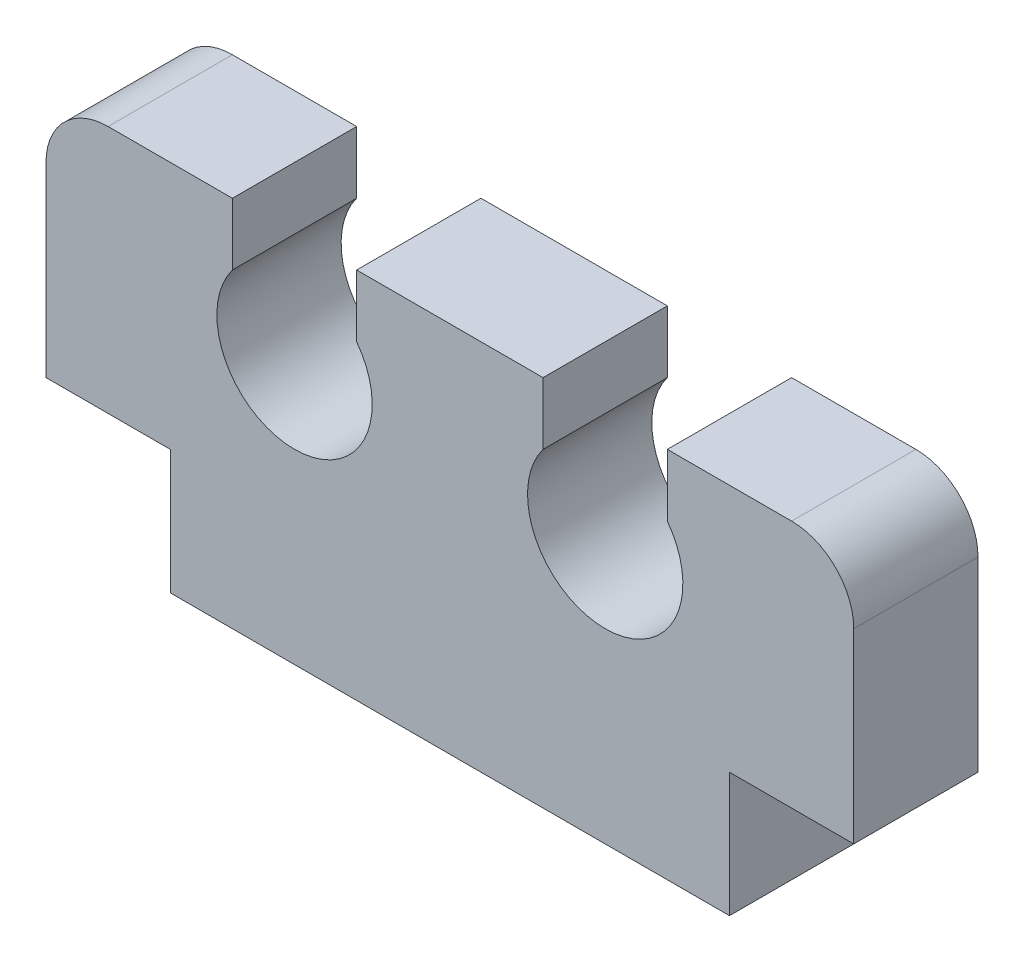
ISO-10303-21;
HEADER;
FILE_DESCRIPTION(('STEP AP214'),'2;1');
FILE_NAME('part.step','',(''),(''),'','','');
FILE_SCHEMA(('AUTOMOTIVE_DESIGN { 1 0 10303 214 1 1 1 1 }'));
ENDSEC;
DATA;
#1=APPLICATION_CONTEXT('core data for automotive mechanical design processes');
#2=APPLICATION_PROTOCOL_DEFINITION('international standard','automotive_design',2000,#1);
#3=PRODUCT_CONTEXT('',#1,'mechanical');
#4=PRODUCT('Part','Part','',(#3));
#5=PRODUCT_RELATED_PRODUCT_CATEGORY('part','',(#4));
#6=PRODUCT_DEFINITION_FORMATION('','',#4);
#7=PRODUCT_DEFINITION_CONTEXT('part definition',#1,'design');
#8=PRODUCT_DEFINITION('design','',#6,#7);
#9=PRODUCT_DEFINITION_SHAPE('','',#8);
#10=(LENGTH_UNIT() NAMED_UNIT(*) SI_UNIT(.MILLI.,.METRE.));
#11=(NAMED_UNIT(*) PLANE_ANGLE_UNIT() SI_UNIT($,.RADIAN.));
#12=(NAMED_UNIT(*) SI_UNIT($,.STERADIAN.) SOLID_ANGLE_UNIT());
#13=UNCERTAINTY_MEASURE_WITH_UNIT(LENGTH_MEASURE(1.E-05),#10,'distance_accuracy_value','');
#14=(GEOMETRIC_REPRESENTATION_CONTEXT(3) GLOBAL_UNCERTAINTY_ASSIGNED_CONTEXT((#13)) GLOBAL_UNIT_ASSIGNED_CONTEXT((#10,
#11,#12)) REPRESENTATION_CONTEXT('',''));
#15=CARTESIAN_POINT('',(0.,0.,0.));
#16=DIRECTION('',(0.,0.,1.));
#17=DIRECTION('',(1.,0.,0.));
#18=AXIS2_PLACEMENT_3D('',#15,#16,#17);
#19=CARTESIAN_POINT('',(10.0000000000022,5.00000000000011,2.));
#20=DIRECTION('',(0.,0.,-1.));
#21=DIRECTION('',(-1.,0.,0.));
#22=AXIS2_PLACEMENT_3D('',#19,#20,#21);
#23=CYLINDRICAL_SURFACE('',#22,1.);
#24=CARTESIAN_POINT('',(10.0000000000022,5.00000000000011,0.));
#25=DIRECTION('',(0.,0.,1.));
#26=DIRECTION('',(1.,0.,0.));
#27=AXIS2_PLACEMENT_3D('',#24,#25,#26);
#28=CIRCLE('',#27,1.);
#29=CARTESIAN_POINT('',(11.0000000000022,5.00000000000011,0.));
#30=VERTEX_POINT('',#29);
#31=CARTESIAN_POINT('',(10.0000000000022,6.00000000000012,0.));
#32=VERTEX_POINT('',#31);
#33=EDGE_CURVE('E189',#30,#32,#28,.T.);
#34=ORIENTED_EDGE('',*,*,#33,.T.);
#35=DIRECTION('',(0.,0.,-1.));
#36=VECTOR('',#35,1.);
#37=CARTESIAN_POINT('',(10.0000000000022,6.00000000000012,2.));
#38=LINE('',#37,#36);
#39=CARTESIAN_POINT('',(10.0000000000022,6.00000000000012,2.));
#40=VERTEX_POINT('',#39);
#41=EDGE_CURVE('E11',#40,#32,#38,.T.);
#42=ORIENTED_EDGE('',*,*,#41,.F.);
#43=CARTESIAN_POINT('',(10.0000000000022,5.00000000000011,2.));
#44=DIRECTION('',(0.,0.,1.));
#45=DIRECTION('',(1.,0.,0.));
#46=AXIS2_PLACEMENT_3D('',#43,#44,#45);
#47=CIRCLE('',#46,1.);
#48=CARTESIAN_POINT('',(11.0000000000022,5.00000000000011,2.));
#49=VERTEX_POINT('',#48);
#50=EDGE_CURVE('E223',#49,#40,#47,.T.);
#51=ORIENTED_EDGE('',*,*,#50,.F.);
#52=DIRECTION('',(0.,0.,-1.));
#53=VECTOR('',#52,1.);
#54=CARTESIAN_POINT('',(11.0000000000022,5.00000000000011,2.));
#55=LINE('',#54,#53);
#56=EDGE_CURVE('E185',#49,#30,#55,.T.);
#57=ORIENTED_EDGE('',*,*,#56,.T.);
#58=EDGE_LOOP('',(#34,#42,#51,#57));
#59=FACE_BOUND('',#58,.T.);
#60=ADVANCED_FACE('F33',(#59),#23,.T.);
#61=CARTESIAN_POINT('',(8.00000000000216,6.00000000000012,2.));
#62=DIRECTION('',(0.,-1.,0.));
#63=DIRECTION('',(0.,0.,-1.));
#64=AXIS2_PLACEMENT_3D('',#61,#62,#63);
#65=PLANE('',#64);
#66=DIRECTION('',(-1.,0.,0.));
#67=VECTOR('',#66,1.);
#68=CARTESIAN_POINT('',(8.00000000000216,6.00000000000012,0.));
#69=LINE('',#68,#67);
#70=CARTESIAN_POINT('',(8.00000000000216,6.00000000000012,0.));
#71=VERTEX_POINT('',#70);
#72=EDGE_CURVE('E192',#32,#71,#69,.T.);
#73=ORIENTED_EDGE('',*,*,#72,.T.);
#74=DIRECTION('',(0.,0.,-1.));
#75=VECTOR('',#74,1.);
#76=CARTESIAN_POINT('',(8.00000000000216,6.00000000000012,2.));
#77=LINE('',#76,#75);
#78=CARTESIAN_POINT('',(8.00000000000216,6.00000000000012,2.));
#79=VERTEX_POINT('',#78);
#80=EDGE_CURVE('E41',#79,#71,#77,.T.);
#81=ORIENTED_EDGE('',*,*,#80,.F.);
#82=DIRECTION('',(-1.,0.,0.));
#83=VECTOR('',#82,1.);
#84=CARTESIAN_POINT('',(8.00000000000216,6.00000000000012,2.));
#85=LINE('',#84,#83);
#86=EDGE_CURVE('E122',#40,#79,#85,.T.);
#87=ORIENTED_EDGE('',*,*,#86,.F.);
#88=ORIENTED_EDGE('',*,*,#41,.T.);
#89=EDGE_LOOP('',(#73,#81,#87,#88));
#90=FACE_BOUND('',#89,.T.);
#91=ADVANCED_FACE('F331',(#90),#65,.F.);
#92=CARTESIAN_POINT('',(8.00000000000216,6.00000000000012,2.));
#93=DIRECTION('',(1.,0.,0.));
#94=DIRECTION('',(0.,0.,-1.));
#95=AXIS2_PLACEMENT_3D('',#92,#93,#94);
#96=PLANE('',#95);
#97=DIRECTION('',(0.,-1.,0.));
#98=VECTOR('',#97,1.);
#99=CARTESIAN_POINT('',(8.00000000000216,6.00000000000012,0.));
#100=LINE('',#99,#98);
#101=CARTESIAN_POINT('',(8.00000000000216,5.00000000000011,0.));
#102=VERTEX_POINT('',#101);
#103=EDGE_CURVE('E194',#71,#102,#100,.T.);
#104=ORIENTED_EDGE('',*,*,#103,.T.);
#105=DIRECTION('',(0.,0.,-1.));
#106=VECTOR('',#105,1.);
#107=CARTESIAN_POINT('',(8.00000000000216,5.00000000000011,2.));
#108=LINE('',#107,#106);
#109=CARTESIAN_POINT('',(8.00000000000216,5.00000000000011,2.));
#110=VERTEX_POINT('',#109);
#111=EDGE_CURVE('E260',#110,#102,#108,.T.);
#112=ORIENTED_EDGE('',*,*,#111,.F.);
#113=DIRECTION('',(0.,-1.,0.));
#114=VECTOR('',#113,1.);
#115=CARTESIAN_POINT('',(8.00000000000216,6.00000000000012,2.));
#116=LINE('',#115,#114);
#117=EDGE_CURVE('E268',#79,#110,#116,.T.);
#118=ORIENTED_EDGE('',*,*,#117,.F.);
#119=ORIENTED_EDGE('',*,*,#80,.T.);
#120=EDGE_LOOP('',(#104,#112,#118,#119));
#121=FACE_BOUND('',#120,.T.);
#122=ADVANCED_FACE('F266',(#121),#96,.F.);
#123=CARTESIAN_POINT('',(7.00000000000165,4.24999999999984,2.));
#124=DIRECTION('',(0.,0.,-1.));
#125=DIRECTION('',(-1.,0.,0.));
#126=AXIS2_PLACEMENT_3D('',#123,#124,#125);
#127=CYLINDRICAL_SURFACE('',#126,1.25000000000057);
#128=CARTESIAN_POINT('',(7.00000000000165,4.24999999999984,0.));
#129=DIRECTION('',(0.,0.,-1.));
#130=DIRECTION('',(1.,0.,0.));
#131=AXIS2_PLACEMENT_3D('',#128,#129,#130);
#132=CIRCLE('',#131,1.25000000000057);
#133=CARTESIAN_POINT('',(6.00000000000114,5.00000000000011,0.));
#134=VERTEX_POINT('',#133);
#135=EDGE_CURVE('E196',#102,#134,#132,.T.);
#136=ORIENTED_EDGE('',*,*,#135,.T.);
#137=DIRECTION('',(0.,0.,-1.));
#138=VECTOR('',#137,1.);
#139=CARTESIAN_POINT('',(6.00000000000114,5.00000000000011,2.));
#140=LINE('',#139,#138);
#141=CARTESIAN_POINT('',(6.00000000000114,5.00000000000011,2.));
#142=VERTEX_POINT('',#141);
#143=EDGE_CURVE('E257',#142,#134,#140,.T.);
#144=ORIENTED_EDGE('',*,*,#143,.F.);
#145=CARTESIAN_POINT('',(7.00000000000165,4.24999999999984,2.));
#146=DIRECTION('',(0.,0.,-1.));
#147=DIRECTION('',(1.,0.,0.));
#148=AXIS2_PLACEMENT_3D('',#145,#146,#147);
#149=CIRCLE('',#148,1.25000000000057);
#150=EDGE_CURVE('E286',#110,#142,#149,.T.);
#151=ORIENTED_EDGE('',*,*,#150,.F.);
#152=ORIENTED_EDGE('',*,*,#111,.T.);
#153=EDGE_LOOP('',(#136,#144,#151,#152));
#154=FACE_BOUND('',#153,.T.);
#155=ADVANCED_FACE('F277',(#154),#127,.F.);
#156=CARTESIAN_POINT('',(6.00000000000114,6.00000000000012,2.));
#157=DIRECTION('',(-1.,0.,0.));
#158=DIRECTION('',(0.,0.,1.));
#159=AXIS2_PLACEMENT_3D('',#156,#157,#158);
#160=PLANE('',#159);
#161=DIRECTION('',(0.,1.,0.));
#162=VECTOR('',#161,1.);
#163=CARTESIAN_POINT('',(6.00000000000114,6.00000000000012,0.));
#164=LINE('',#163,#162);
#165=CARTESIAN_POINT('',(6.00000000000114,6.00000000000012,0.));
#166=VERTEX_POINT('',#165);
#167=EDGE_CURVE('E198',#134,#166,#164,.T.);
#168=ORIENTED_EDGE('',*,*,#167,.T.);
#169=DIRECTION('',(0.,0.,-1.));
#170=VECTOR('',#169,1.);
#171=CARTESIAN_POINT('',(6.00000000000114,6.00000000000012,2.));
#172=LINE('',#171,#170);
#173=CARTESIAN_POINT('',(6.00000000000114,6.00000000000012,2.));
#174=VERTEX_POINT('',#173);
#175=EDGE_CURVE('E254',#174,#166,#172,.T.);
#176=ORIENTED_EDGE('',*,*,#175,.F.);
#177=DIRECTION('',(0.,1.,0.));
#178=VECTOR('',#177,1.);
#179=CARTESIAN_POINT('',(6.00000000000114,6.00000000000012,2.));
#180=LINE('',#179,#178);
#181=EDGE_CURVE('E283',#142,#174,#180,.T.);
#182=ORIENTED_EDGE('',*,*,#181,.F.);
#183=ORIENTED_EDGE('',*,*,#143,.T.);
#184=EDGE_LOOP('',(#168,#176,#182,#183));
#185=FACE_BOUND('',#184,.T.);
#186=ADVANCED_FACE('F281',(#185),#160,.F.);
#187=CARTESIAN_POINT('',(3.00000000000102,6.00000000000012,2.));
#188=DIRECTION('',(0.,-1.,0.));
#189=DIRECTION('',(1.,0.,0.));
#190=AXIS2_PLACEMENT_3D('',#187,#188,#189);
#191=PLANE('',#190);
#192=DIRECTION('',(-1.,0.,0.));
#193=VECTOR('',#192,1.);
#194=CARTESIAN_POINT('',(3.00000000000102,6.00000000000012,0.));
#195=LINE('',#194,#193);
#196=CARTESIAN_POINT('',(3.00000000000102,6.00000000000012,0.));
#197=VERTEX_POINT('',#196);
#198=EDGE_CURVE('E200',#166,#197,#195,.T.);
#199=ORIENTED_EDGE('',*,*,#198,.T.);
#200=DIRECTION('',(0.,0.,-1.));
#201=VECTOR('',#200,1.);
#202=CARTESIAN_POINT('',(3.00000000000102,6.00000000000012,2.));
#203=LINE('',#202,#201);
#204=CARTESIAN_POINT('',(3.00000000000102,6.00000000000012,2.));
#205=VERTEX_POINT('',#204);
#206=EDGE_CURVE('E251',#205,#197,#203,.T.);
#207=ORIENTED_EDGE('',*,*,#206,.F.);
#208=DIRECTION('',(-1.,0.,0.));
#209=VECTOR('',#208,1.);
#210=CARTESIAN_POINT('',(3.00000000000102,6.00000000000012,2.));
#211=LINE('',#210,#209);
#212=EDGE_CURVE('E285',#174,#205,#211,.T.);
#213=ORIENTED_EDGE('',*,*,#212,.F.);
#214=ORIENTED_EDGE('',*,*,#175,.T.);
#215=EDGE_LOOP('',(#199,#207,#213,#214));
#216=FACE_BOUND('',#215,.T.);
#217=ADVANCED_FACE('F344',(#216),#191,.F.);
#218=CARTESIAN_POINT('',(3.00000000000102,6.00000000000012,2.));
#219=DIRECTION('',(1.,0.,0.));
#220=DIRECTION('',(0.,1.,0.));
#221=AXIS2_PLACEMENT_3D('',#218,#219,#220);
#222=PLANE('',#221);
#223=DIRECTION('',(0.,-1.,0.));
#224=VECTOR('',#223,1.);
#225=CARTESIAN_POINT('',(3.00000000000102,6.00000000000012,0.));
#226=LINE('',#225,#224);
#227=CARTESIAN_POINT('',(3.00000000000103,5.00000000000011,0.));
#228=VERTEX_POINT('',#227);
#229=EDGE_CURVE('E202',#197,#228,#226,.T.);
#230=ORIENTED_EDGE('',*,*,#229,.T.);
#231=DIRECTION('',(0.,0.,-1.));
#232=VECTOR('',#231,1.);
#233=CARTESIAN_POINT('',(3.00000000000103,5.00000000000011,2.));
#234=LINE('',#233,#232);
#235=CARTESIAN_POINT('',(3.00000000000103,5.00000000000011,2.));
#236=VERTEX_POINT('',#235);
#237=EDGE_CURVE('E248',#236,#228,#234,.T.);
#238=ORIENTED_EDGE('',*,*,#237,.F.);
#239=DIRECTION('',(0.,-1.,0.));
#240=VECTOR('',#239,1.);
#241=CARTESIAN_POINT('',(3.00000000000102,6.00000000000012,2.));
#242=LINE('',#241,#240);
#243=EDGE_CURVE('E288',#205,#236,#242,.T.);
#244=ORIENTED_EDGE('',*,*,#243,.F.);
#245=ORIENTED_EDGE('',*,*,#206,.T.);
#246=EDGE_LOOP('',(#230,#238,#244,#245));
#247=FACE_BOUND('',#246,.T.);
#248=ADVANCED_FACE('F347',(#247),#222,.F.);
#249=CARTESIAN_POINT('',(2.00000000000051,4.24999999999984,2.));
#250=DIRECTION('',(0.,0.,-1.));
#251=DIRECTION('',(-1.,0.,0.));
#252=AXIS2_PLACEMENT_3D('',#249,#250,#251);
#253=CYLINDRICAL_SURFACE('',#252,1.25000000000057);
#254=CARTESIAN_POINT('',(2.00000000000051,4.24999999999984,0.));
#255=DIRECTION('',(0.,0.,-1.));
#256=DIRECTION('',(1.,0.,0.));
#257=AXIS2_PLACEMENT_3D('',#254,#255,#256);
#258=CIRCLE('',#257,1.25000000000057);
#259=CARTESIAN_POINT('',(1.,5.00000000000012,0.));
#260=VERTEX_POINT('',#259);
#261=EDGE_CURVE('E204',#228,#260,#258,.T.);
#262=ORIENTED_EDGE('',*,*,#261,.T.);
#263=DIRECTION('',(0.,0.,-1.));
#264=VECTOR('',#263,1.);
#265=CARTESIAN_POINT('',(1.,5.00000000000012,2.));
#266=LINE('',#265,#264);
#267=CARTESIAN_POINT('',(1.,5.00000000000012,2.));
#268=VERTEX_POINT('',#267);
#269=EDGE_CURVE('E245',#268,#260,#266,.T.);
#270=ORIENTED_EDGE('',*,*,#269,.F.);
#271=CARTESIAN_POINT('',(2.00000000000051,4.24999999999984,2.));
#272=DIRECTION('',(0.,0.,-1.));
#273=DIRECTION('',(1.,0.,0.));
#274=AXIS2_PLACEMENT_3D('',#271,#272,#273);
#275=CIRCLE('',#274,1.25000000000057);
#276=EDGE_CURVE('E294',#236,#268,#275,.T.);
#277=ORIENTED_EDGE('',*,*,#276,.F.);
#278=ORIENTED_EDGE('',*,*,#237,.T.);
#279=EDGE_LOOP('',(#262,#270,#277,#278));
#280=FACE_BOUND('',#279,.T.);
#281=ADVANCED_FACE('F351',(#280),#253,.F.);
#282=CARTESIAN_POINT('',(1.,6.00000000000012,2.));
#283=DIRECTION('',(-1.,0.,0.));
#284=DIRECTION('',(0.,0.,1.));
#285=AXIS2_PLACEMENT_3D('',#282,#283,#284);
#286=PLANE('',#285);
#287=DIRECTION('',(0.,1.,0.));
#288=VECTOR('',#287,1.);
#289=CARTESIAN_POINT('',(1.,6.00000000000012,0.));
#290=LINE('',#289,#288);
#291=CARTESIAN_POINT('',(1.,6.00000000000012,0.));
#292=VERTEX_POINT('',#291);
#293=EDGE_CURVE('E206',#260,#292,#290,.T.);
#294=ORIENTED_EDGE('',*,*,#293,.T.);
#295=DIRECTION('',(0.,0.,-1.));
#296=VECTOR('',#295,1.);
#297=CARTESIAN_POINT('',(1.,6.00000000000012,2.));
#298=LINE('',#297,#296);
#299=CARTESIAN_POINT('',(1.,6.00000000000012,2.));
#300=VERTEX_POINT('',#299);
#301=EDGE_CURVE('E242',#300,#292,#298,.T.);
#302=ORIENTED_EDGE('',*,*,#301,.F.);
#303=DIRECTION('',(0.,1.,0.));
#304=VECTOR('',#303,1.);
#305=CARTESIAN_POINT('',(1.,6.00000000000012,2.));
#306=LINE('',#305,#304);
#307=EDGE_CURVE('E296',#268,#300,#306,.T.);
#308=ORIENTED_EDGE('',*,*,#307,.F.);
#309=ORIENTED_EDGE('',*,*,#269,.T.);
#310=EDGE_LOOP('',(#294,#302,#308,#309));
#311=FACE_BOUND('',#310,.T.);
#312=ADVANCED_FACE('F355',(#311),#286,.F.);
#313=CARTESIAN_POINT('',(1.,6.00000000000012,2.));
#314=DIRECTION('',(0.,-1.,0.));
#315=DIRECTION('',(1.,0.,0.));
#316=AXIS2_PLACEMENT_3D('',#313,#314,#315);
#317=PLANE('',#316);
#318=DIRECTION('',(-1.,0.,0.));
#319=VECTOR('',#318,1.);
#320=CARTESIAN_POINT('',(1.,6.00000000000012,0.));
#321=LINE('',#320,#319);
#322=CARTESIAN_POINT('',(-1.,6.00000000000012,0.));
#323=VERTEX_POINT('',#322);
#324=EDGE_CURVE('E208',#292,#323,#321,.T.);
#325=ORIENTED_EDGE('',*,*,#324,.T.);
#326=DIRECTION('',(0.,0.,-1.));
#327=VECTOR('',#326,1.);
#328=CARTESIAN_POINT('',(-1.,6.00000000000012,2.));
#329=LINE('',#328,#327);
#330=CARTESIAN_POINT('',(-1.,6.00000000000012,2.));
#331=VERTEX_POINT('',#330);
#332=EDGE_CURVE('E239',#331,#323,#329,.T.);
#333=ORIENTED_EDGE('',*,*,#332,.F.);
#334=DIRECTION('',(-1.,0.,0.));
#335=VECTOR('',#334,1.);
#336=CARTESIAN_POINT('',(1.,6.00000000000012,2.));
#337=LINE('',#336,#335);
#338=EDGE_CURVE('E298',#300,#331,#337,.T.);
#339=ORIENTED_EDGE('',*,*,#338,.F.);
#340=ORIENTED_EDGE('',*,*,#301,.T.);
#341=EDGE_LOOP('',(#325,#333,#339,#340));
#342=FACE_BOUND('',#341,.T.);
#343=ADVANCED_FACE('F359',(#342),#317,.F.);
#344=CARTESIAN_POINT('',(-1.,5.00000000000012,2.));
#345=DIRECTION('',(0.,0.,-1.));
#346=DIRECTION('',(-1.,0.,0.));
#347=AXIS2_PLACEMENT_3D('',#344,#345,#346);
#348=CYLINDRICAL_SURFACE('',#347,1.);
#349=CARTESIAN_POINT('',(-1.,5.00000000000012,0.));
#350=DIRECTION('',(0.,0.,1.));
#351=DIRECTION('',(1.,0.,0.));
#352=AXIS2_PLACEMENT_3D('',#349,#350,#351);
#353=CIRCLE('',#352,1.);
#354=CARTESIAN_POINT('',(-2.,5.00000000000012,0.));
#355=VERTEX_POINT('',#354);
#356=EDGE_CURVE('E210',#323,#355,#353,.T.);
#357=ORIENTED_EDGE('',*,*,#356,.T.);
#358=DIRECTION('',(0.,0.,-1.));
#359=VECTOR('',#358,1.);
#360=CARTESIAN_POINT('',(-2.,5.00000000000012,2.));
#361=LINE('',#360,#359);
#362=CARTESIAN_POINT('',(-2.,5.00000000000012,2.));
#363=VERTEX_POINT('',#362);
#364=EDGE_CURVE('E236',#363,#355,#361,.T.);
#365=ORIENTED_EDGE('',*,*,#364,.F.);
#366=CARTESIAN_POINT('',(-1.,5.00000000000012,2.));
#367=DIRECTION('',(0.,0.,1.));
#368=DIRECTION('',(1.,0.,0.));
#369=AXIS2_PLACEMENT_3D('',#366,#367,#368);
#370=CIRCLE('',#369,1.);
#371=EDGE_CURVE('E300',#331,#363,#370,.T.);
#372=ORIENTED_EDGE('',*,*,#371,.F.);
#373=ORIENTED_EDGE('',*,*,#332,.T.);
#374=EDGE_LOOP('',(#357,#365,#372,#373));
#375=FACE_BOUND('',#374,.T.);
#376=ADVANCED_FACE('F363',(#375),#348,.T.);
#377=CARTESIAN_POINT('',(-2.,2.,2.));
#378=DIRECTION('',(1.,0.,0.));
#379=DIRECTION('',(0.,0.,-1.));
#380=AXIS2_PLACEMENT_3D('',#377,#378,#379);
#381=PLANE('',#380);
#382=DIRECTION('',(0.,-1.,0.));
#383=VECTOR('',#382,1.);
#384=CARTESIAN_POINT('',(-2.,2.,0.));
#385=LINE('',#384,#383);
#386=CARTESIAN_POINT('',(-2.,2.,0.));
#387=VERTEX_POINT('',#386);
#388=EDGE_CURVE('E212',#355,#387,#385,.T.);
#389=ORIENTED_EDGE('',*,*,#388,.T.);
#390=DIRECTION('',(0.,0.,-1.));
#391=VECTOR('',#390,1.);
#392=CARTESIAN_POINT('',(-2.,2.,2.));
#393=LINE('',#392,#391);
#394=CARTESIAN_POINT('',(-2.,2.,2.));
#395=VERTEX_POINT('',#394);
#396=EDGE_CURVE('E233',#395,#387,#393,.T.);
#397=ORIENTED_EDGE('',*,*,#396,.F.);
#398=DIRECTION('',(0.,-1.,0.));
#399=VECTOR('',#398,1.);
#400=CARTESIAN_POINT('',(-2.,2.,2.));
#401=LINE('',#400,#399);
#402=EDGE_CURVE('E302',#363,#395,#401,.T.);
#403=ORIENTED_EDGE('',*,*,#402,.F.);
#404=ORIENTED_EDGE('',*,*,#364,.T.);
#405=EDGE_LOOP('',(#389,#397,#403,#404));
#406=FACE_BOUND('',#405,.T.);
#407=ADVANCED_FACE('F367',(#406),#381,.F.);
#408=CARTESIAN_POINT('',(0.,2.,2.));
#409=DIRECTION('',(0.,1.,0.));
#410=DIRECTION('',(-1.,0.,0.));
#411=AXIS2_PLACEMENT_3D('',#408,#409,#410);
#412=PLANE('',#411);
#413=DIRECTION('',(1.,0.,0.));
#414=VECTOR('',#413,1.);
#415=CARTESIAN_POINT('',(0.,2.,0.));
#416=LINE('',#415,#414);
#417=CARTESIAN_POINT('',(0.,2.,0.));
#418=VERTEX_POINT('',#417);
#419=EDGE_CURVE('E214',#387,#418,#416,.T.);
#420=ORIENTED_EDGE('',*,*,#419,.T.);
#421=DIRECTION('',(0.,0.,-1.));
#422=VECTOR('',#421,1.);
#423=CARTESIAN_POINT('',(0.,2.,2.));
#424=LINE('',#423,#422);
#425=CARTESIAN_POINT('',(0.,2.,2.));
#426=VERTEX_POINT('',#425);
#427=EDGE_CURVE('E230',#426,#418,#424,.T.);
#428=ORIENTED_EDGE('',*,*,#427,.F.);
#429=DIRECTION('',(1.,0.,0.));
#430=VECTOR('',#429,1.);
#431=CARTESIAN_POINT('',(0.,2.,2.));
#432=LINE('',#431,#430);
#433=EDGE_CURVE('E304',#395,#426,#432,.T.);
#434=ORIENTED_EDGE('',*,*,#433,.F.);
#435=ORIENTED_EDGE('',*,*,#396,.T.);
#436=EDGE_LOOP('',(#420,#428,#434,#435));
#437=FACE_BOUND('',#436,.T.);
#438=ADVANCED_FACE('F371',(#437),#412,.F.);
#439=CARTESIAN_POINT('',(0.,2.,2.));
#440=DIRECTION('',(1.,0.,0.));
#441=DIRECTION('',(0.,0.,-1.));
#442=AXIS2_PLACEMENT_3D('',#439,#440,#441);
#443=PLANE('',#442);
#444=DIRECTION('',(0.,-1.,0.));
#445=VECTOR('',#444,1.);
#446=CARTESIAN_POINT('',(0.,2.,0.));
#447=LINE('',#446,#445);
#448=CARTESIAN_POINT('',(0.,0.,0.));
#449=VERTEX_POINT('',#448);
#450=EDGE_CURVE('E216',#418,#449,#447,.T.);
#451=ORIENTED_EDGE('',*,*,#450,.T.);
#452=DIRECTION('',(0.,0.,-1.));
#453=VECTOR('',#452,1.);
#454=CARTESIAN_POINT('',(0.,0.,2.));
#455=LINE('',#454,#453);
#456=CARTESIAN_POINT('',(0.,0.,2.));
#457=VERTEX_POINT('',#456);
#458=EDGE_CURVE('E227',#457,#449,#455,.T.);
#459=ORIENTED_EDGE('',*,*,#458,.F.);
#460=DIRECTION('',(0.,-1.,0.));
#461=VECTOR('',#460,1.);
#462=CARTESIAN_POINT('',(0.,2.,2.));
#463=LINE('',#462,#461);
#464=EDGE_CURVE('E306',#426,#457,#463,.T.);
#465=ORIENTED_EDGE('',*,*,#464,.F.);
#466=ORIENTED_EDGE('',*,*,#427,.T.);
#467=EDGE_LOOP('',(#451,#459,#465,#466));
#468=FACE_BOUND('',#467,.T.);
#469=ADVANCED_FACE('F312',(#468),#443,.F.);
#470=CARTESIAN_POINT('',(0.,0.,2.));
#471=DIRECTION('',(0.,1.,0.));
#472=DIRECTION('',(-1.,0.,0.));
#473=AXIS2_PLACEMENT_3D('',#470,#471,#472);
#474=PLANE('',#473);
#475=DIRECTION('',(1.,0.,0.));
#476=VECTOR('',#475,1.);
#477=CARTESIAN_POINT('',(0.,0.,0.));
#478=LINE('',#477,#476);
#479=CARTESIAN_POINT('',(9.00000000000216,0.,0.));
#480=VERTEX_POINT('',#479);
#481=EDGE_CURVE('E218',#449,#480,#478,.T.);
#482=ORIENTED_EDGE('',*,*,#481,.T.);
#483=DIRECTION('',(0.,0.,-1.));
#484=VECTOR('',#483,1.);
#485=CARTESIAN_POINT('',(9.00000000000216,0.,2.));
#486=LINE('',#485,#484);
#487=CARTESIAN_POINT('',(9.00000000000216,0.,2.));
#488=VERTEX_POINT('',#487);
#489=EDGE_CURVE('E180',#488,#480,#486,.T.);
#490=ORIENTED_EDGE('',*,*,#489,.F.);
#491=DIRECTION('',(1.,0.,0.));
#492=VECTOR('',#491,1.);
#493=CARTESIAN_POINT('',(0.,0.,2.));
#494=LINE('',#493,#492);
#495=EDGE_CURVE('E171',#457,#488,#494,.T.);
#496=ORIENTED_EDGE('',*,*,#495,.F.);
#497=ORIENTED_EDGE('',*,*,#458,.T.);
#498=EDGE_LOOP('',(#482,#490,#496,#497));
#499=FACE_BOUND('',#498,.T.);
#500=ADVANCED_FACE('F316',(#499),#474,.F.);
#501=CARTESIAN_POINT('',(9.00000000000216,2.,2.));
#502=DIRECTION('',(-1.,0.,0.));
#503=DIRECTION('',(0.,0.,1.));
#504=AXIS2_PLACEMENT_3D('',#501,#502,#503);
#505=PLANE('',#504);
#506=DIRECTION('',(0.,1.,0.));
#507=VECTOR('',#506,1.);
#508=CARTESIAN_POINT('',(9.00000000000216,2.,0.));
#509=LINE('',#508,#507);
#510=CARTESIAN_POINT('',(9.00000000000216,2.,0.));
#511=VERTEX_POINT('',#510);
#512=EDGE_CURVE('E179',#480,#511,#509,.T.);
#513=ORIENTED_EDGE('',*,*,#512,.T.);
#514=DIRECTION('',(0.,0.,-1.));
#515=VECTOR('',#514,1.);
#516=CARTESIAN_POINT('',(9.00000000000216,2.,2.));
#517=LINE('',#516,#515);
#518=CARTESIAN_POINT('',(9.00000000000216,2.,2.));
#519=VERTEX_POINT('',#518);
#520=EDGE_CURVE('E176',#519,#511,#517,.T.);
#521=ORIENTED_EDGE('',*,*,#520,.F.);
#522=DIRECTION('',(0.,1.,0.));
#523=VECTOR('',#522,1.);
#524=CARTESIAN_POINT('',(9.00000000000216,2.,2.));
#525=LINE('',#524,#523);
#526=EDGE_CURVE('E165',#488,#519,#525,.T.);
#527=ORIENTED_EDGE('',*,*,#526,.F.);
#528=ORIENTED_EDGE('',*,*,#489,.T.);
#529=EDGE_LOOP('',(#513,#521,#527,#528));
#530=FACE_BOUND('',#529,.T.);
#531=ADVANCED_FACE('F177',(#530),#505,.F.);
#532=CARTESIAN_POINT('',(9.00000000000216,2.,2.));
#533=DIRECTION('',(0.,1.,0.));
#534=DIRECTION('',(0.,0.,1.));
#535=AXIS2_PLACEMENT_3D('',#532,#533,#534);
#536=PLANE('',#535);
#537=DIRECTION('',(1.,0.,0.));
#538=VECTOR('',#537,1.);
#539=CARTESIAN_POINT('',(9.00000000000216,2.,0.));
#540=LINE('',#539,#538);
#541=CARTESIAN_POINT('',(11.0000000000022,2.,0.));
#542=VERTEX_POINT('',#541);
#543=EDGE_CURVE('E108',#511,#542,#540,.T.);
#544=ORIENTED_EDGE('',*,*,#543,.T.);
#545=DIRECTION('',(0.,0.,-1.));
#546=VECTOR('',#545,1.);
#547=CARTESIAN_POINT('',(11.0000000000022,2.,2.));
#548=LINE('',#547,#546);
#549=CARTESIAN_POINT('',(11.0000000000022,2.,2.));
#550=VERTEX_POINT('',#549);
#551=EDGE_CURVE('E181',#550,#542,#548,.T.);
#552=ORIENTED_EDGE('',*,*,#551,.F.);
#553=DIRECTION('',(1.,0.,0.));
#554=VECTOR('',#553,1.);
#555=CARTESIAN_POINT('',(9.00000000000216,2.,2.));
#556=LINE('',#555,#554);
#557=EDGE_CURVE('E169',#519,#550,#556,.T.);
#558=ORIENTED_EDGE('',*,*,#557,.F.);
#559=ORIENTED_EDGE('',*,*,#520,.T.);
#560=EDGE_LOOP('',(#544,#552,#558,#559));
#561=FACE_BOUND('',#560,.T.);
#562=ADVANCED_FACE('F183',(#561),#536,.F.);
#563=CARTESIAN_POINT('',(11.0000000000022,2.,2.));
#564=DIRECTION('',(-1.,0.,0.));
#565=DIRECTION('',(0.,0.,1.));
#566=AXIS2_PLACEMENT_3D('',#563,#564,#565);
#567=PLANE('',#566);
#568=DIRECTION('',(0.,1.,0.));
#569=VECTOR('',#568,1.);
#570=CARTESIAN_POINT('',(11.0000000000022,2.,0.));
#571=LINE('',#570,#569);
#572=EDGE_CURVE('E114',#542,#30,#571,.T.);
#573=ORIENTED_EDGE('',*,*,#572,.T.);
#574=ORIENTED_EDGE('',*,*,#56,.F.);
#575=DIRECTION('',(0.,1.,0.));
#576=VECTOR('',#575,1.);
#577=CARTESIAN_POINT('',(11.0000000000022,2.,2.));
#578=LINE('',#577,#576);
#579=EDGE_CURVE('E49',#550,#49,#578,.T.);
#580=ORIENTED_EDGE('',*,*,#579,.F.);
#581=ORIENTED_EDGE('',*,*,#551,.T.);
#582=EDGE_LOOP('',(#573,#574,#580,#581));
#583=FACE_BOUND('',#582,.T.);
#584=ADVANCED_FACE('F320',(#583),#567,.F.);
#585=CARTESIAN_POINT('',(10.0000000000022,5.00000000000011,2.));
#586=DIRECTION('',(0.,0.,1.));
#587=DIRECTION('',(1.,0.,0.));
#588=AXIS2_PLACEMENT_3D('',#585,#586,#587);
#589=PLANE('',#588);
#590=ORIENTED_EDGE('',*,*,#50,.T.);
#591=ORIENTED_EDGE('',*,*,#86,.T.);
#592=ORIENTED_EDGE('',*,*,#117,.T.);
#593=ORIENTED_EDGE('',*,*,#150,.T.);
#594=ORIENTED_EDGE('',*,*,#181,.T.);
#595=ORIENTED_EDGE('',*,*,#212,.T.);
#596=ORIENTED_EDGE('',*,*,#243,.T.);
#597=ORIENTED_EDGE('',*,*,#276,.T.);
#598=ORIENTED_EDGE('',*,*,#307,.T.);
#599=ORIENTED_EDGE('',*,*,#338,.T.);
#600=ORIENTED_EDGE('',*,*,#371,.T.);
#601=ORIENTED_EDGE('',*,*,#402,.T.);
#602=ORIENTED_EDGE('',*,*,#433,.T.);
#603=ORIENTED_EDGE('',*,*,#464,.T.);
#604=ORIENTED_EDGE('',*,*,#495,.T.);
#605=ORIENTED_EDGE('',*,*,#526,.T.);
#606=ORIENTED_EDGE('',*,*,#557,.T.);
#607=ORIENTED_EDGE('',*,*,#579,.T.);
#608=EDGE_LOOP('',(#590,#591,#592,#593,#594,#595,#596,#597,#598,#599,#600,#601,#602,#603,#604,
#605,#606,#607));
#609=FACE_BOUND('',#608,.T.);
#610=ADVANCED_FACE('F167',(#609),#589,.T.);
#611=CARTESIAN_POINT('',(10.0000000000022,5.00000000000011,0.));
#612=DIRECTION('',(0.,0.,1.));
#613=DIRECTION('',(1.,0.,0.));
#614=AXIS2_PLACEMENT_3D('',#611,#612,#613);
#615=PLANE('',#614);
#616=ORIENTED_EDGE('',*,*,#33,.F.);
#617=ORIENTED_EDGE('',*,*,#572,.F.);
#618=ORIENTED_EDGE('',*,*,#543,.F.);
#619=ORIENTED_EDGE('',*,*,#512,.F.);
#620=ORIENTED_EDGE('',*,*,#481,.F.);
#621=ORIENTED_EDGE('',*,*,#450,.F.);
#622=ORIENTED_EDGE('',*,*,#419,.F.);
#623=ORIENTED_EDGE('',*,*,#388,.F.);
#624=ORIENTED_EDGE('',*,*,#356,.F.);
#625=ORIENTED_EDGE('',*,*,#324,.F.);
#626=ORIENTED_EDGE('',*,*,#293,.F.);
#627=ORIENTED_EDGE('',*,*,#261,.F.);
#628=ORIENTED_EDGE('',*,*,#229,.F.);
#629=ORIENTED_EDGE('',*,*,#198,.F.);
#630=ORIENTED_EDGE('',*,*,#167,.F.);
#631=ORIENTED_EDGE('',*,*,#135,.F.);
#632=ORIENTED_EDGE('',*,*,#103,.F.);
#633=ORIENTED_EDGE('',*,*,#72,.F.);
#634=EDGE_LOOP('',(#616,#617,#618,#619,#620,#621,#622,#623,#624,#625,#626,#627,#628,#629,#630,
#631,#632,#633));
#635=FACE_BOUND('',#634,.T.);
#636=ADVANCED_FACE('F272',(#635),#615,.F.);
#637=CLOSED_SHELL('',(#60,#91,#122,#155,#186,#217,#248,#281,#312,#343,#376,#407,#438,#469,#500,
#531,#562,#584,#610,#636));
#638=MANIFOLD_SOLID_BREP('B2',#637);
#639=ADVANCED_BREP_SHAPE_REPRESENTATION('',(#18,#638),#14);
#640=SHAPE_DEFINITION_REPRESENTATION(#9,#639);
ENDSEC;
END-ISO-10303-21;
